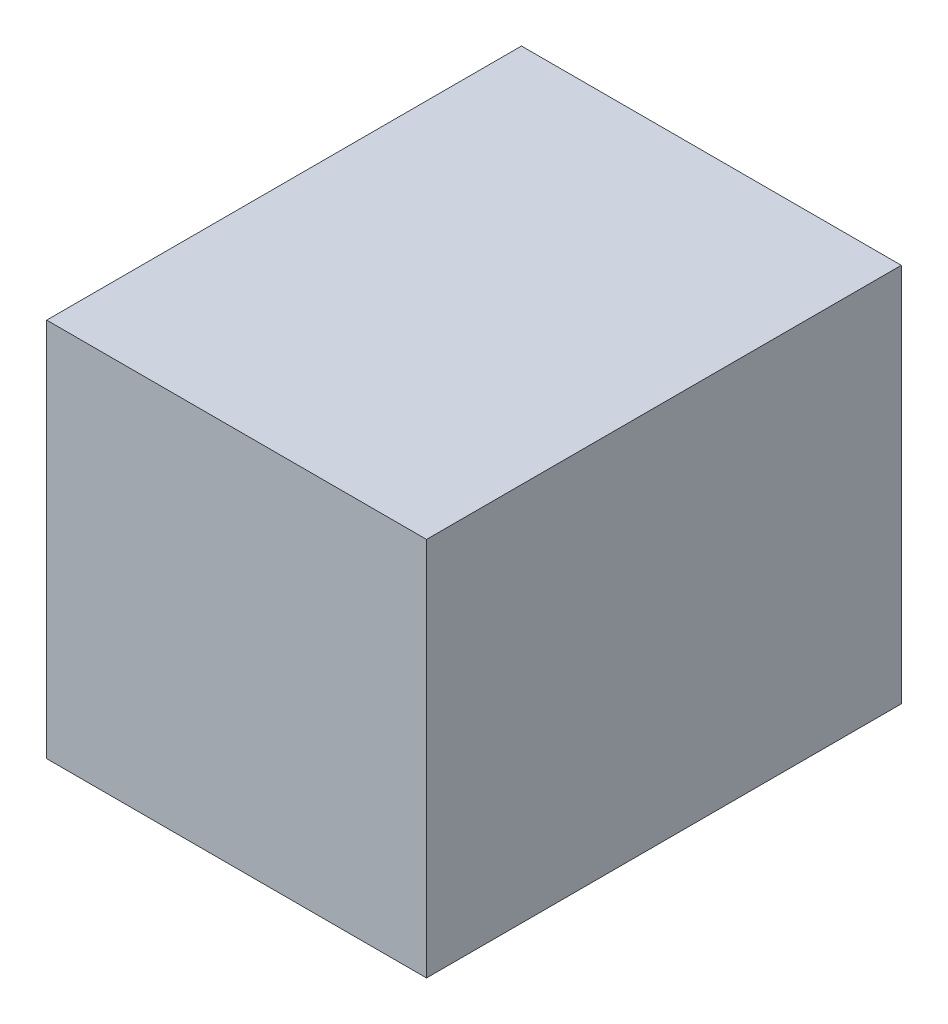
ISO-10303-21;
HEADER;
FILE_DESCRIPTION(('STEP AP214'),'2;1');
FILE_NAME('part.step','',(''),(''),'','','');
FILE_SCHEMA(('AUTOMOTIVE_DESIGN { 1 0 10303 214 1 1 1 1 }'));
ENDSEC;
DATA;
#1=APPLICATION_CONTEXT('core data for automotive mechanical design processes');
#2=APPLICATION_PROTOCOL_DEFINITION('international standard','automotive_design',2000,#1);
#3=PRODUCT_CONTEXT('',#1,'mechanical');
#4=PRODUCT('Part','Part','',(#3));
#5=PRODUCT_RELATED_PRODUCT_CATEGORY('part','',(#4));
#6=PRODUCT_DEFINITION_FORMATION('','',#4);
#7=PRODUCT_DEFINITION_CONTEXT('part definition',#1,'design');
#8=PRODUCT_DEFINITION('design','',#6,#7);
#9=PRODUCT_DEFINITION_SHAPE('','',#8);
#10=(LENGTH_UNIT() NAMED_UNIT(*) SI_UNIT(.MILLI.,.METRE.));
#11=(NAMED_UNIT(*) PLANE_ANGLE_UNIT() SI_UNIT($,.RADIAN.));
#12=(NAMED_UNIT(*) SI_UNIT($,.STERADIAN.) SOLID_ANGLE_UNIT());
#13=UNCERTAINTY_MEASURE_WITH_UNIT(LENGTH_MEASURE(1.E-05),#10,'distance_accuracy_value','');
#14=(GEOMETRIC_REPRESENTATION_CONTEXT(3) GLOBAL_UNCERTAINTY_ASSIGNED_CONTEXT((#13)) GLOBAL_UNIT_ASSIGNED_CONTEXT((#10,
#11,#12)) REPRESENTATION_CONTEXT('',''));
#15=CARTESIAN_POINT('',(0.,0.,0.));
#16=DIRECTION('',(0.,0.,1.));
#17=DIRECTION('',(1.,0.,0.));
#18=AXIS2_PLACEMENT_3D('',#15,#16,#17);
#19=CARTESIAN_POINT('',(0.4,0.8,-0.5));
#20=DIRECTION('',(-1.,0.,0.));
#21=DIRECTION('',(0.,0.,1.));
#22=AXIS2_PLACEMENT_3D('',#19,#20,#21);
#23=PLANE('',#22);
#24=DIRECTION('',(0.,0.,-1.));
#25=VECTOR('',#24,1.);
#26=CARTESIAN_POINT('',(0.4,0.,-0.5));
#27=LINE('',#26,#25);
#28=CARTESIAN_POINT('',(0.4,0.,0.5));
#29=VERTEX_POINT('',#28);
#30=CARTESIAN_POINT('',(0.4,0.,-0.5));
#31=VERTEX_POINT('',#30);
#32=EDGE_CURVE('E100',#29,#31,#27,.T.);
#33=ORIENTED_EDGE('',*,*,#32,.T.);
#34=DIRECTION('',(0.,-1.,0.));
#35=VECTOR('',#34,1.);
#36=CARTESIAN_POINT('',(0.4,0.8,-0.5));
#37=LINE('',#36,#35);
#38=CARTESIAN_POINT('',(0.4,0.8,-0.5));
#39=VERTEX_POINT('',#38);
#40=EDGE_CURVE('E11',#39,#31,#37,.T.);
#41=ORIENTED_EDGE('',*,*,#40,.F.);
#42=DIRECTION('',(0.,0.,-1.));
#43=VECTOR('',#42,1.);
#44=CARTESIAN_POINT('',(0.4,0.8,-0.5));
#45=LINE('',#44,#43);
#46=CARTESIAN_POINT('',(0.4,0.8,0.5));
#47=VERTEX_POINT('',#46);
#48=EDGE_CURVE('E88',#47,#39,#45,.T.);
#49=ORIENTED_EDGE('',*,*,#48,.F.);
#50=DIRECTION('',(0.,-1.,0.));
#51=VECTOR('',#50,1.);
#52=CARTESIAN_POINT('',(0.4,0.8,0.5));
#53=LINE('',#52,#51);
#54=EDGE_CURVE('E96',#47,#29,#53,.T.);
#55=ORIENTED_EDGE('',*,*,#54,.T.);
#56=EDGE_LOOP('',(#33,#41,#49,#55));
#57=FACE_BOUND('',#56,.T.);
#58=ADVANCED_FACE('F37',(#57),#23,.F.);
#59=CARTESIAN_POINT('',(-0.4,0.8,-0.5));
#60=DIRECTION('',(0.,0.,1.));
#61=DIRECTION('',(1.,0.,0.));
#62=AXIS2_PLACEMENT_3D('',#59,#60,#61);
#63=PLANE('',#62);
#64=DIRECTION('',(-1.,0.,0.));
#65=VECTOR('',#64,1.);
#66=CARTESIAN_POINT('',(-0.4,0.,-0.5));
#67=LINE('',#66,#65);
#68=CARTESIAN_POINT('',(-0.4,0.,-0.5));
#69=VERTEX_POINT('',#68);
#70=EDGE_CURVE('E92',#31,#69,#67,.T.);
#71=ORIENTED_EDGE('',*,*,#70,.T.);
#72=DIRECTION('',(0.,-1.,0.));
#73=VECTOR('',#72,1.);
#74=CARTESIAN_POINT('',(-0.4,0.8,-0.5));
#75=LINE('',#74,#73);
#76=CARTESIAN_POINT('',(-0.4,0.8,-0.5));
#77=VERTEX_POINT('',#76);
#78=EDGE_CURVE('E45',#77,#69,#75,.T.);
#79=ORIENTED_EDGE('',*,*,#78,.F.);
#80=DIRECTION('',(-1.,0.,0.));
#81=VECTOR('',#80,1.);
#82=CARTESIAN_POINT('',(-0.4,0.8,-0.5));
#83=LINE('',#82,#81);
#84=EDGE_CURVE('E83',#39,#77,#83,.T.);
#85=ORIENTED_EDGE('',*,*,#84,.F.);
#86=ORIENTED_EDGE('',*,*,#40,.T.);
#87=EDGE_LOOP('',(#71,#79,#85,#86));
#88=FACE_BOUND('',#87,.T.);
#89=ADVANCED_FACE('F91',(#88),#63,.F.);
#90=CARTESIAN_POINT('',(-0.4,0.8,-0.5));
#91=DIRECTION('',(1.,0.,0.));
#92=DIRECTION('',(0.,0.,-1.));
#93=AXIS2_PLACEMENT_3D('',#90,#91,#92);
#94=PLANE('',#93);
#95=DIRECTION('',(0.,0.,1.));
#96=VECTOR('',#95,1.);
#97=CARTESIAN_POINT('',(-0.4,0.,-0.5));
#98=LINE('',#97,#96);
#99=CARTESIAN_POINT('',(-0.4,0.,0.5));
#100=VERTEX_POINT('',#99);
#101=EDGE_CURVE('E70',#69,#100,#98,.T.);
#102=ORIENTED_EDGE('',*,*,#101,.T.);
#103=DIRECTION('',(0.,-1.,0.));
#104=VECTOR('',#103,1.);
#105=CARTESIAN_POINT('',(-0.4,0.8,0.5));
#106=LINE('',#105,#104);
#107=CARTESIAN_POINT('',(-0.4,0.8,0.5));
#108=VERTEX_POINT('',#107);
#109=EDGE_CURVE('E93',#108,#100,#106,.T.);
#110=ORIENTED_EDGE('',*,*,#109,.F.);
#111=DIRECTION('',(0.,0.,1.));
#112=VECTOR('',#111,1.);
#113=CARTESIAN_POINT('',(-0.4,0.8,-0.5));
#114=LINE('',#113,#112);
#115=EDGE_CURVE('E86',#77,#108,#114,.T.);
#116=ORIENTED_EDGE('',*,*,#115,.F.);
#117=ORIENTED_EDGE('',*,*,#78,.T.);
#118=EDGE_LOOP('',(#102,#110,#116,#117));
#119=FACE_BOUND('',#118,.T.);
#120=ADVANCED_FACE('F94',(#119),#94,.F.);
#121=CARTESIAN_POINT('',(-0.4,0.8,0.5));
#122=DIRECTION('',(0.,0.,-1.));
#123=DIRECTION('',(-1.,0.,0.));
#124=AXIS2_PLACEMENT_3D('',#121,#122,#123);
#125=PLANE('',#124);
#126=DIRECTION('',(1.,0.,0.));
#127=VECTOR('',#126,1.);
#128=CARTESIAN_POINT('',(-0.4,0.,0.5));
#129=LINE('',#128,#127);
#130=EDGE_CURVE('E76',#100,#29,#129,.T.);
#131=ORIENTED_EDGE('',*,*,#130,.T.);
#132=ORIENTED_EDGE('',*,*,#54,.F.);
#133=DIRECTION('',(1.,0.,0.));
#134=VECTOR('',#133,1.);
#135=CARTESIAN_POINT('',(-0.4,0.8,0.5));
#136=LINE('',#135,#134);
#137=EDGE_CURVE('E53',#108,#47,#136,.T.);
#138=ORIENTED_EDGE('',*,*,#137,.F.);
#139=ORIENTED_EDGE('',*,*,#109,.T.);
#140=EDGE_LOOP('',(#131,#132,#138,#139));
#141=FACE_BOUND('',#140,.T.);
#142=ADVANCED_FACE('F107',(#141),#125,.F.);
#143=CARTESIAN_POINT('',(0.,0.8,0.));
#144=DIRECTION('',(0.,1.,0.));
#145=DIRECTION('',(0.,0.,1.));
#146=AXIS2_PLACEMENT_3D('',#143,#144,#145);
#147=PLANE('',#146);
#148=ORIENTED_EDGE('',*,*,#48,.T.);
#149=ORIENTED_EDGE('',*,*,#84,.T.);
#150=ORIENTED_EDGE('',*,*,#115,.T.);
#151=ORIENTED_EDGE('',*,*,#137,.T.);
#152=EDGE_LOOP('',(#148,#149,#150,#151));
#153=FACE_BOUND('',#152,.T.);
#154=ADVANCED_FACE('F84',(#153),#147,.T.);
#155=CARTESIAN_POINT('',(0.,0.,0.));
#156=DIRECTION('',(0.,1.,0.));
#157=DIRECTION('',(0.,0.,1.));
#158=AXIS2_PLACEMENT_3D('',#155,#156,#157);
#159=PLANE('',#158);
#160=ORIENTED_EDGE('',*,*,#32,.F.);
#161=ORIENTED_EDGE('',*,*,#130,.F.);
#162=ORIENTED_EDGE('',*,*,#101,.F.);
#163=ORIENTED_EDGE('',*,*,#70,.F.);
#164=EDGE_LOOP('',(#160,#161,#162,#163));
#165=FACE_BOUND('',#164,.T.);
#166=ADVANCED_FACE('F110',(#165),#159,.F.);
#167=CLOSED_SHELL('',(#58,#89,#120,#142,#154,#166));
#168=MANIFOLD_SOLID_BREP('B2',#167);
#169=ADVANCED_BREP_SHAPE_REPRESENTATION('',(#18,#168),#14);
#170=SHAPE_DEFINITION_REPRESENTATION(#9,#169);
ENDSEC;
END-ISO-10303-21;
